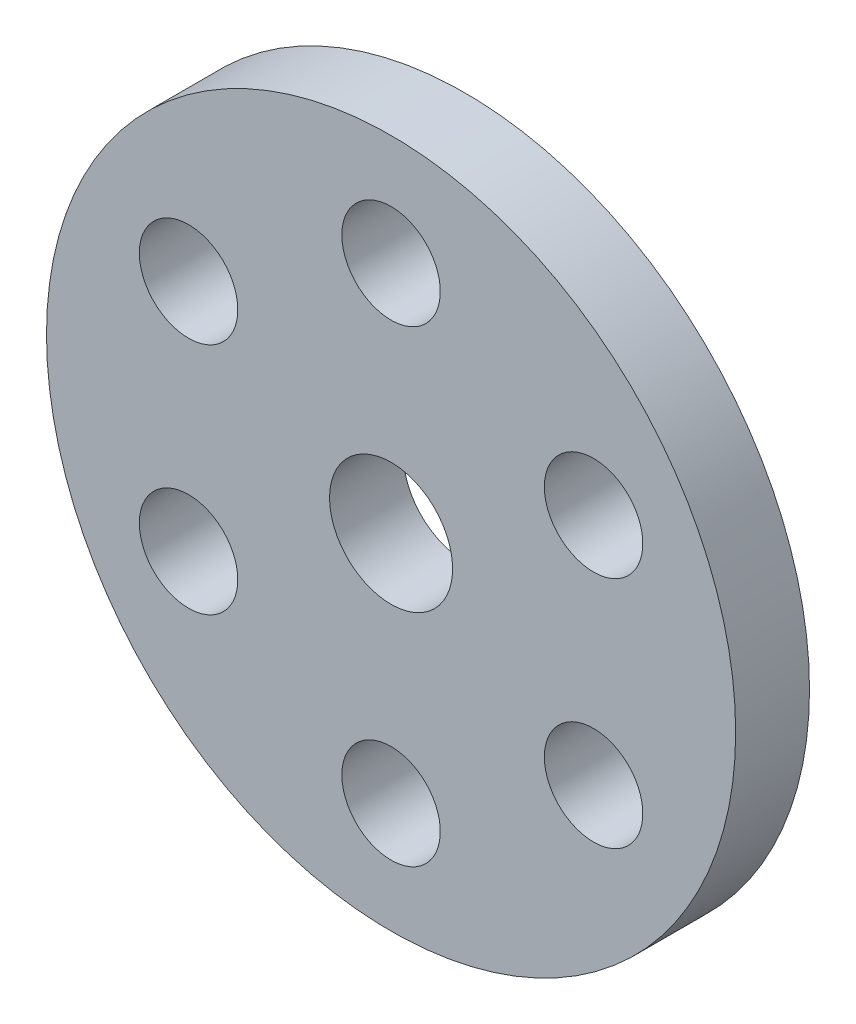
ISO-10303-21;
HEADER;
FILE_DESCRIPTION(('STEP AP214'),'2;1');
FILE_NAME('part.step','',(''),(''),'','','');
FILE_SCHEMA(('AUTOMOTIVE_DESIGN { 1 0 10303 214 1 1 1 1 }'));
ENDSEC;
DATA;
#1=APPLICATION_CONTEXT('core data for automotive mechanical design processes');
#2=APPLICATION_PROTOCOL_DEFINITION('international standard','automotive_design',2000,#1);
#3=PRODUCT_CONTEXT('',#1,'mechanical');
#4=PRODUCT('Part','Part','',(#3));
#5=PRODUCT_RELATED_PRODUCT_CATEGORY('part','',(#4));
#6=PRODUCT_DEFINITION_FORMATION('','',#4);
#7=PRODUCT_DEFINITION_CONTEXT('part definition',#1,'design');
#8=PRODUCT_DEFINITION('design','',#6,#7);
#9=PRODUCT_DEFINITION_SHAPE('','',#8);
#10=(LENGTH_UNIT() NAMED_UNIT(*) SI_UNIT(.MILLI.,.METRE.));
#11=(NAMED_UNIT(*) PLANE_ANGLE_UNIT() SI_UNIT($,.RADIAN.));
#12=(NAMED_UNIT(*) SI_UNIT($,.STERADIAN.) SOLID_ANGLE_UNIT());
#13=UNCERTAINTY_MEASURE_WITH_UNIT(LENGTH_MEASURE(1.E-05),#10,'distance_accuracy_value','');
#14=(GEOMETRIC_REPRESENTATION_CONTEXT(3) GLOBAL_UNCERTAINTY_ASSIGNED_CONTEXT((#13)) GLOBAL_UNIT_ASSIGNED_CONTEXT((#10,
#11,#12)) REPRESENTATION_CONTEXT('',''));
#15=CARTESIAN_POINT('',(0.,0.,0.));
#16=DIRECTION('',(0.,0.,1.));
#17=DIRECTION('',(1.,0.,0.));
#18=AXIS2_PLACEMENT_3D('',#15,#16,#17);
#19=CARTESIAN_POINT('',(0.,0.,-3.));
#20=DIRECTION('',(0.,0.,-1.));
#21=DIRECTION('',(-1.,0.,0.));
#22=AXIS2_PLACEMENT_3D('',#19,#20,#21);
#23=PLANE('',#22);
#24=CARTESIAN_POINT('',(8.22724133595136,-4.75000000000047,-3.));
#25=DIRECTION('',(0.,0.,-1.));
#26=DIRECTION('',(-1.,0.,0.));
#27=AXIS2_PLACEMENT_3D('',#24,#25,#26);
#28=CIRCLE('',#27,2.);
#29=CARTESIAN_POINT('',(6.22724133595136,-4.75000000000047,-3.));
#30=VERTEX_POINT('',#29);
#31=EDGE_CURVE('E79',#30,#30,#28,.T.);
#32=ORIENTED_EDGE('',*,*,#31,.F.);
#33=EDGE_LOOP('',(#32));
#34=FACE_BOUND('',#33,.T.);
#35=CARTESIAN_POINT('',(-8.22724133595298,-4.74999999999953,-3.));
#36=DIRECTION('',(0.,0.,-1.));
#37=DIRECTION('',(-1.,0.,0.));
#38=AXIS2_PLACEMENT_3D('',#35,#36,#37);
#39=CIRCLE('',#38,2.);
#40=CARTESIAN_POINT('',(-10.227241335953,-4.74999999999953,-3.));
#41=VERTEX_POINT('',#40);
#42=EDGE_CURVE('E67',#41,#41,#39,.T.);
#43=ORIENTED_EDGE('',*,*,#42,.F.);
#44=EDGE_LOOP('',(#43));
#45=FACE_BOUND('',#44,.T.);
#46=CARTESIAN_POINT('',(0.,9.5,-3.));
#47=DIRECTION('',(0.,0.,-1.));
#48=DIRECTION('',(-1.,0.,0.));
#49=AXIS2_PLACEMENT_3D('',#46,#47,#48);
#50=CIRCLE('',#49,2.);
#51=CARTESIAN_POINT('',(-2.,9.5,-3.));
#52=VERTEX_POINT('',#51);
#53=EDGE_CURVE('E55',#52,#52,#50,.T.);
#54=ORIENTED_EDGE('',*,*,#53,.F.);
#55=EDGE_LOOP('',(#54));
#56=FACE_BOUND('',#55,.T.);
#57=CARTESIAN_POINT('',(0.,0.,-3.));
#58=DIRECTION('',(0.,0.,-1.));
#59=DIRECTION('',(-1.,0.,0.));
#60=AXIS2_PLACEMENT_3D('',#57,#58,#59);
#61=CIRCLE('',#60,14.);
#62=CARTESIAN_POINT('',(-14.,0.,-3.));
#63=VERTEX_POINT('',#62);
#64=EDGE_CURVE('E10',#63,#63,#61,.T.);
#65=ORIENTED_EDGE('',*,*,#64,.T.);
#66=EDGE_LOOP('',(#65));
#67=FACE_BOUND('',#66,.T.);
#68=CARTESIAN_POINT('',(0.,0.,-3.));
#69=DIRECTION('',(0.,0.,-1.));
#70=DIRECTION('',(-1.,0.,0.));
#71=AXIS2_PLACEMENT_3D('',#68,#69,#70);
#72=CIRCLE('',#71,2.5);
#73=CARTESIAN_POINT('',(-2.5,0.,-3.));
#74=VERTEX_POINT('',#73);
#75=EDGE_CURVE('E50',#74,#74,#72,.T.);
#76=ORIENTED_EDGE('',*,*,#75,.F.);
#77=EDGE_LOOP('',(#76));
#78=FACE_BOUND('',#77,.T.);
#79=CARTESIAN_POINT('',(-8.22724133595243,4.75000000000047,-3.));
#80=DIRECTION('',(0.,0.,-1.));
#81=DIRECTION('',(-1.,0.,0.));
#82=AXIS2_PLACEMENT_3D('',#79,#80,#81);
#83=CIRCLE('',#82,2.);
#84=CARTESIAN_POINT('',(-10.2272413359524,4.75000000000047,-3.));
#85=VERTEX_POINT('',#84);
#86=EDGE_CURVE('E61',#85,#85,#83,.T.);
#87=ORIENTED_EDGE('',*,*,#86,.F.);
#88=EDGE_LOOP('',(#87));
#89=FACE_BOUND('',#88,.T.);
#90=CARTESIAN_POINT('',(-1.07769812943697E-12,-9.5,-3.));
#91=DIRECTION('',(0.,0.,-1.));
#92=DIRECTION('',(-1.,0.,0.));
#93=AXIS2_PLACEMENT_3D('',#90,#91,#92);
#94=CIRCLE('',#93,2.);
#95=CARTESIAN_POINT('',(-2.00000000000108,-9.5,-3.));
#96=VERTEX_POINT('',#95);
#97=EDGE_CURVE('E73',#96,#96,#94,.T.);
#98=ORIENTED_EDGE('',*,*,#97,.F.);
#99=EDGE_LOOP('',(#98));
#100=FACE_BOUND('',#99,.T.);
#101=CARTESIAN_POINT('',(8.2272413359519,4.74999999999953,-3.));
#102=DIRECTION('',(0.,0.,-1.));
#103=DIRECTION('',(-1.,0.,0.));
#104=AXIS2_PLACEMENT_3D('',#101,#102,#103);
#105=CIRCLE('',#104,2.);
#106=CARTESIAN_POINT('',(6.2272413359519,4.74999999999953,-3.));
#107=VERTEX_POINT('',#106);
#108=EDGE_CURVE('E85',#107,#107,#105,.T.);
#109=ORIENTED_EDGE('',*,*,#108,.F.);
#110=EDGE_LOOP('',(#109));
#111=FACE_BOUND('',#110,.T.);
#112=ADVANCED_FACE('F39',(#34,#45,#56,#67,#78,#89,#100,#111),#23,.T.);
#113=CARTESIAN_POINT('',(0.,0.,0.));
#114=DIRECTION('',(0.,0.,-1.));
#115=DIRECTION('',(-1.,0.,0.));
#116=AXIS2_PLACEMENT_3D('',#113,#114,#115);
#117=PLANE('',#116);
#118=CARTESIAN_POINT('',(0.,0.,0.));
#119=DIRECTION('',(0.,0.,-1.));
#120=DIRECTION('',(-1.,0.,0.));
#121=AXIS2_PLACEMENT_3D('',#118,#119,#120);
#122=CIRCLE('',#121,14.);
#123=CARTESIAN_POINT('',(-14.,0.,0.));
#124=VERTEX_POINT('',#123);
#125=EDGE_CURVE('E43',#124,#124,#122,.T.);
#126=ORIENTED_EDGE('',*,*,#125,.F.);
#127=EDGE_LOOP('',(#126));
#128=FACE_BOUND('',#127,.T.);
#129=CARTESIAN_POINT('',(0.,0.,0.));
#130=DIRECTION('',(0.,0.,-1.));
#131=DIRECTION('',(-1.,0.,0.));
#132=AXIS2_PLACEMENT_3D('',#129,#130,#131);
#133=CIRCLE('',#132,2.5);
#134=CARTESIAN_POINT('',(-2.5,0.,0.));
#135=VERTEX_POINT('',#134);
#136=EDGE_CURVE('E52',#135,#135,#133,.T.);
#137=ORIENTED_EDGE('',*,*,#136,.T.);
#138=EDGE_LOOP('',(#137));
#139=FACE_BOUND('',#138,.T.);
#140=CARTESIAN_POINT('',(0.,9.5,0.));
#141=DIRECTION('',(0.,0.,-1.));
#142=DIRECTION('',(-1.,0.,0.));
#143=AXIS2_PLACEMENT_3D('',#140,#141,#142);
#144=CIRCLE('',#143,2.);
#145=CARTESIAN_POINT('',(-2.,9.5,0.));
#146=VERTEX_POINT('',#145);
#147=EDGE_CURVE('E58',#146,#146,#144,.T.);
#148=ORIENTED_EDGE('',*,*,#147,.T.);
#149=EDGE_LOOP('',(#148));
#150=FACE_BOUND('',#149,.T.);
#151=CARTESIAN_POINT('',(-8.22724133595243,4.75000000000047,0.));
#152=DIRECTION('',(0.,0.,-1.));
#153=DIRECTION('',(-1.,0.,0.));
#154=AXIS2_PLACEMENT_3D('',#151,#152,#153);
#155=CIRCLE('',#154,2.);
#156=CARTESIAN_POINT('',(-10.2272413359524,4.75000000000047,0.));
#157=VERTEX_POINT('',#156);
#158=EDGE_CURVE('E64',#157,#157,#155,.T.);
#159=ORIENTED_EDGE('',*,*,#158,.T.);
#160=EDGE_LOOP('',(#159));
#161=FACE_BOUND('',#160,.T.);
#162=CARTESIAN_POINT('',(-8.22724133595298,-4.74999999999953,0.));
#163=DIRECTION('',(0.,0.,-1.));
#164=DIRECTION('',(-1.,0.,0.));
#165=AXIS2_PLACEMENT_3D('',#162,#163,#164);
#166=CIRCLE('',#165,2.);
#167=CARTESIAN_POINT('',(-10.227241335953,-4.74999999999953,0.));
#168=VERTEX_POINT('',#167);
#169=EDGE_CURVE('E70',#168,#168,#166,.T.);
#170=ORIENTED_EDGE('',*,*,#169,.T.);
#171=EDGE_LOOP('',(#170));
#172=FACE_BOUND('',#171,.T.);
#173=CARTESIAN_POINT('',(-1.07769812943697E-12,-9.5,0.));
#174=DIRECTION('',(0.,0.,-1.));
#175=DIRECTION('',(-1.,0.,0.));
#176=AXIS2_PLACEMENT_3D('',#173,#174,#175);
#177=CIRCLE('',#176,2.);
#178=CARTESIAN_POINT('',(-2.00000000000108,-9.5,0.));
#179=VERTEX_POINT('',#178);
#180=EDGE_CURVE('E76',#179,#179,#177,.T.);
#181=ORIENTED_EDGE('',*,*,#180,.T.);
#182=EDGE_LOOP('',(#181));
#183=FACE_BOUND('',#182,.T.);
#184=CARTESIAN_POINT('',(8.22724133595136,-4.75000000000047,0.));
#185=DIRECTION('',(0.,0.,-1.));
#186=DIRECTION('',(-1.,0.,0.));
#187=AXIS2_PLACEMENT_3D('',#184,#185,#186);
#188=CIRCLE('',#187,2.);
#189=CARTESIAN_POINT('',(6.22724133595136,-4.75000000000047,0.));
#190=VERTEX_POINT('',#189);
#191=EDGE_CURVE('E82',#190,#190,#188,.T.);
#192=ORIENTED_EDGE('',*,*,#191,.T.);
#193=EDGE_LOOP('',(#192));
#194=FACE_BOUND('',#193,.T.);
#195=CARTESIAN_POINT('',(8.2272413359519,4.74999999999953,0.));
#196=DIRECTION('',(0.,0.,-1.));
#197=DIRECTION('',(-1.,0.,0.));
#198=AXIS2_PLACEMENT_3D('',#195,#196,#197);
#199=CIRCLE('',#198,2.);
#200=CARTESIAN_POINT('',(6.2272413359519,4.74999999999953,0.));
#201=VERTEX_POINT('',#200);
#202=EDGE_CURVE('E88',#201,#201,#199,.T.);
#203=ORIENTED_EDGE('',*,*,#202,.T.);
#204=EDGE_LOOP('',(#203));
#205=FACE_BOUND('',#204,.T.);
#206=ADVANCED_FACE('F98',(#128,#139,#150,#161,#172,#183,#194,#205),#117,.F.);
#207=CARTESIAN_POINT('',(0.,0.,-3.));
#208=DIRECTION('',(0.,0.,1.));
#209=DIRECTION('',(1.,0.,0.));
#210=AXIS2_PLACEMENT_3D('',#207,#208,#209);
#211=CYLINDRICAL_SURFACE('',#210,14.);
#212=ORIENTED_EDGE('',*,*,#64,.F.);
#213=EDGE_LOOP('',(#212));
#214=FACE_BOUND('',#213,.T.);
#215=ORIENTED_EDGE('',*,*,#125,.T.);
#216=EDGE_LOOP('',(#215));
#217=FACE_BOUND('',#216,.T.);
#218=ADVANCED_FACE('F41',(#214,#217),#211,.T.);
#219=CARTESIAN_POINT('',(0.,0.,-3.));
#220=DIRECTION('',(0.,0.,1.));
#221=DIRECTION('',(1.,0.,0.));
#222=AXIS2_PLACEMENT_3D('',#219,#220,#221);
#223=CYLINDRICAL_SURFACE('',#222,2.5);
#224=ORIENTED_EDGE('',*,*,#75,.T.);
#225=EDGE_LOOP('',(#224));
#226=FACE_BOUND('',#225,.T.);
#227=ORIENTED_EDGE('',*,*,#136,.F.);
#228=EDGE_LOOP('',(#227));
#229=FACE_BOUND('',#228,.T.);
#230=ADVANCED_FACE('F109',(#226,#229),#223,.F.);
#231=CARTESIAN_POINT('',(0.,9.5,-3.));
#232=DIRECTION('',(0.,0.,1.));
#233=DIRECTION('',(1.,0.,0.));
#234=AXIS2_PLACEMENT_3D('',#231,#232,#233);
#235=CYLINDRICAL_SURFACE('',#234,2.);
#236=ORIENTED_EDGE('',*,*,#53,.T.);
#237=EDGE_LOOP('',(#236));
#238=FACE_BOUND('',#237,.T.);
#239=ORIENTED_EDGE('',*,*,#147,.F.);
#240=EDGE_LOOP('',(#239));
#241=FACE_BOUND('',#240,.T.);
#242=ADVANCED_FACE('F112',(#238,#241),#235,.F.);
#243=CARTESIAN_POINT('',(-8.22724133595243,4.75000000000047,-3.));
#244=DIRECTION('',(0.,0.,1.));
#245=DIRECTION('',(1.,0.,0.));
#246=AXIS2_PLACEMENT_3D('',#243,#244,#245);
#247=CYLINDRICAL_SURFACE('',#246,2.);
#248=ORIENTED_EDGE('',*,*,#86,.T.);
#249=EDGE_LOOP('',(#248));
#250=FACE_BOUND('',#249,.T.);
#251=ORIENTED_EDGE('',*,*,#158,.F.);
#252=EDGE_LOOP('',(#251));
#253=FACE_BOUND('',#252,.T.);
#254=ADVANCED_FACE('F116',(#250,#253),#247,.F.);
#255=CARTESIAN_POINT('',(-8.22724133595298,-4.74999999999953,-3.));
#256=DIRECTION('',(0.,0.,1.));
#257=DIRECTION('',(1.,0.,0.));
#258=AXIS2_PLACEMENT_3D('',#255,#256,#257);
#259=CYLINDRICAL_SURFACE('',#258,2.);
#260=ORIENTED_EDGE('',*,*,#42,.T.);
#261=EDGE_LOOP('',(#260));
#262=FACE_BOUND('',#261,.T.);
#263=ORIENTED_EDGE('',*,*,#169,.F.);
#264=EDGE_LOOP('',(#263));
#265=FACE_BOUND('',#264,.T.);
#266=ADVANCED_FACE('F120',(#262,#265),#259,.F.);
#267=CARTESIAN_POINT('',(-1.07769812943697E-12,-9.5,-3.));
#268=DIRECTION('',(0.,0.,1.));
#269=DIRECTION('',(1.,0.,0.));
#270=AXIS2_PLACEMENT_3D('',#267,#268,#269);
#271=CYLINDRICAL_SURFACE('',#270,2.);
#272=ORIENTED_EDGE('',*,*,#97,.T.);
#273=EDGE_LOOP('',(#272));
#274=FACE_BOUND('',#273,.T.);
#275=ORIENTED_EDGE('',*,*,#180,.F.);
#276=EDGE_LOOP('',(#275));
#277=FACE_BOUND('',#276,.T.);
#278=ADVANCED_FACE('F124',(#274,#277),#271,.F.);
#279=CARTESIAN_POINT('',(8.22724133595136,-4.75000000000047,-3.));
#280=DIRECTION('',(0.,0.,1.));
#281=DIRECTION('',(1.,0.,0.));
#282=AXIS2_PLACEMENT_3D('',#279,#280,#281);
#283=CYLINDRICAL_SURFACE('',#282,2.);
#284=ORIENTED_EDGE('',*,*,#31,.T.);
#285=EDGE_LOOP('',(#284));
#286=FACE_BOUND('',#285,.T.);
#287=ORIENTED_EDGE('',*,*,#191,.F.);
#288=EDGE_LOOP('',(#287));
#289=FACE_BOUND('',#288,.T.);
#290=ADVANCED_FACE('F128',(#286,#289),#283,.F.);
#291=CARTESIAN_POINT('',(8.2272413359519,4.74999999999953,-3.));
#292=DIRECTION('',(0.,0.,1.));
#293=DIRECTION('',(1.,0.,0.));
#294=AXIS2_PLACEMENT_3D('',#291,#292,#293);
#295=CYLINDRICAL_SURFACE('',#294,2.);
#296=ORIENTED_EDGE('',*,*,#108,.T.);
#297=EDGE_LOOP('',(#296));
#298=FACE_BOUND('',#297,.T.);
#299=ORIENTED_EDGE('',*,*,#202,.F.);
#300=EDGE_LOOP('',(#299));
#301=FACE_BOUND('',#300,.T.);
#302=ADVANCED_FACE('F94',(#298,#301),#295,.F.);
#303=CLOSED_SHELL('',(#112,#206,#218,#230,#242,#254,#266,#278,#290,#302));
#304=MANIFOLD_SOLID_BREP('B2',#303);
#305=ADVANCED_BREP_SHAPE_REPRESENTATION('',(#18,#304),#14);
#306=SHAPE_DEFINITION_REPRESENTATION(#9,#305);
ENDSEC;
END-ISO-10303-21;
